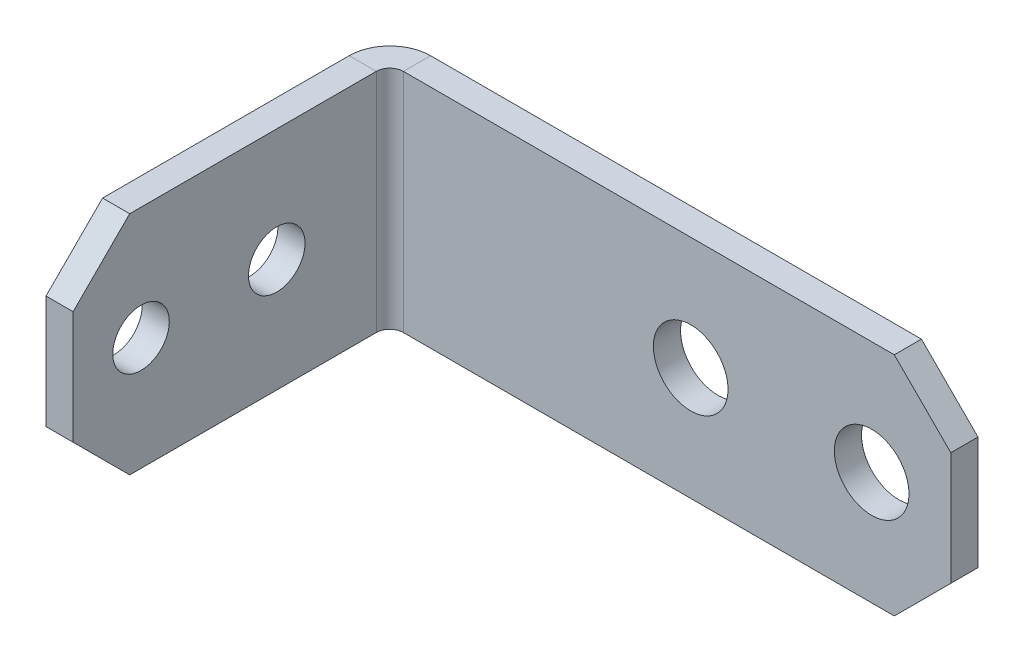
ISO-10303-21;
HEADER;
FILE_DESCRIPTION(('STEP AP214'),'2;1');
FILE_NAME('part.step','',(''),(''),'','','');
FILE_SCHEMA(('AUTOMOTIVE_DESIGN { 1 0 10303 214 1 1 1 1 }'));
ENDSEC;
DATA;
#1=APPLICATION_CONTEXT('core data for automotive mechanical design processes');
#2=APPLICATION_PROTOCOL_DEFINITION('international standard','automotive_design',2000,#1);
#3=PRODUCT_CONTEXT('',#1,'mechanical');
#4=PRODUCT('Part','Part','',(#3));
#5=PRODUCT_RELATED_PRODUCT_CATEGORY('part','',(#4));
#6=PRODUCT_DEFINITION_FORMATION('','',#4);
#7=PRODUCT_DEFINITION_CONTEXT('part definition',#1,'design');
#8=PRODUCT_DEFINITION('design','',#6,#7);
#9=PRODUCT_DEFINITION_SHAPE('','',#8);
#10=(LENGTH_UNIT() NAMED_UNIT(*) SI_UNIT(.MILLI.,.METRE.));
#11=(NAMED_UNIT(*) PLANE_ANGLE_UNIT() SI_UNIT($,.RADIAN.));
#12=(NAMED_UNIT(*) SI_UNIT($,.STERADIAN.) SOLID_ANGLE_UNIT());
#13=UNCERTAINTY_MEASURE_WITH_UNIT(LENGTH_MEASURE(1.E-05),#10,'distance_accuracy_value','');
#14=(GEOMETRIC_REPRESENTATION_CONTEXT(3) GLOBAL_UNCERTAINTY_ASSIGNED_CONTEXT((#13)) GLOBAL_UNIT_ASSIGNED_CONTEXT((#10,
#11,#12)) REPRESENTATION_CONTEXT('',''));
#15=CARTESIAN_POINT('',(0.,0.,0.));
#16=DIRECTION('',(0.,0.,1.));
#17=DIRECTION('',(1.,0.,0.));
#18=AXIS2_PLACEMENT_3D('',#15,#16,#17);
#19=CARTESIAN_POINT('',(13.,5.,1.2));
#20=DIRECTION('',(0.,0.,1.));
#21=DIRECTION('',(1.,0.,0.));
#22=AXIS2_PLACEMENT_3D('',#19,#20,#21);
#23=PLANE('',#22);
#24=CARTESIAN_POINT('',(22.5,5.,1.2));
#25=DIRECTION('',(0.,0.,-1.));
#26=DIRECTION('',(1.,0.,0.));
#27=AXIS2_PLACEMENT_3D('',#24,#25,#26);
#28=CIRCLE('',#27,1.65);
#29=CARTESIAN_POINT('',(20.85,5.,1.2));
#30=VERTEX_POINT('',#29);
#31=EDGE_CURVE('E221',#30,#30,#28,.T.);
#32=ORIENTED_EDGE('',*,*,#31,.T.);
#33=EDGE_LOOP('',(#32));
#34=FACE_BOUND('',#33,.T.);
#35=CARTESIAN_POINT('',(14.5,5.,1.2));
#36=DIRECTION('',(0.,0.,-1.));
#37=DIRECTION('',(1.,0.,0.));
#38=AXIS2_PLACEMENT_3D('',#35,#36,#37);
#39=CIRCLE('',#38,1.65);
#40=CARTESIAN_POINT('',(12.85,5.,1.2));
#41=VERTEX_POINT('',#40);
#42=EDGE_CURVE('E27',#41,#41,#39,.T.);
#43=ORIENTED_EDGE('',*,*,#42,.T.);
#44=EDGE_LOOP('',(#43));
#45=FACE_BOUND('',#44,.T.);
#46=DIRECTION('',(-0.707106781186548,-0.707106781186548,0.));
#47=VECTOR('',#46,1.);
#48=CARTESIAN_POINT('',(22.75,-0.75,1.2));
#49=LINE('',#48,#47);
#50=CARTESIAN_POINT('',(26.,2.5,1.2));
#51=VERTEX_POINT('',#50);
#52=CARTESIAN_POINT('',(23.5,0.,1.2));
#53=VERTEX_POINT('',#52);
#54=EDGE_CURVE('E263',#51,#53,#49,.T.);
#55=ORIENTED_EDGE('',*,*,#54,.F.);
#56=DIRECTION('',(0.,1.,0.));
#57=VECTOR('',#56,1.);
#58=CARTESIAN_POINT('',(26.,0.,1.2));
#59=LINE('',#58,#57);
#60=CARTESIAN_POINT('',(26.,7.5,1.2));
#61=VERTEX_POINT('',#60);
#62=EDGE_CURVE('E234',#51,#61,#59,.T.);
#63=ORIENTED_EDGE('',*,*,#62,.T.);
#64=DIRECTION('',(0.707106781186548,-0.707106781186548,0.));
#65=VECTOR('',#64,1.);
#66=CARTESIAN_POINT('',(22.75,10.75,1.2));
#67=LINE('',#66,#65);
#68=CARTESIAN_POINT('',(23.5,10.,1.2));
#69=VERTEX_POINT('',#68);
#70=EDGE_CURVE('E227',#69,#61,#67,.T.);
#71=ORIENTED_EDGE('',*,*,#70,.F.);
#72=DIRECTION('',(-1.,0.,0.));
#73=VECTOR('',#72,1.);
#74=CARTESIAN_POINT('',(26.,10.,1.2));
#75=LINE('',#74,#73);
#76=CARTESIAN_POINT('',(1.8,10.,1.2));
#77=VERTEX_POINT('',#76);
#78=EDGE_CURVE('E117',#69,#77,#75,.T.);
#79=ORIENTED_EDGE('',*,*,#78,.T.);
#80=DIRECTION('',(0.,-1.,0.));
#81=VECTOR('',#80,1.);
#82=CARTESIAN_POINT('',(1.8,7.5,1.2));
#83=LINE('',#82,#81);
#84=CARTESIAN_POINT('',(1.8,0.,1.2));
#85=VERTEX_POINT('',#84);
#86=EDGE_CURVE('E128',#77,#85,#83,.T.);
#87=ORIENTED_EDGE('',*,*,#86,.T.);
#88=DIRECTION('',(1.,0.,0.));
#89=VECTOR('',#88,1.);
#90=CARTESIAN_POINT('',(0.,0.,1.2));
#91=LINE('',#90,#89);
#92=EDGE_CURVE('E218',#85,#53,#91,.T.);
#93=ORIENTED_EDGE('',*,*,#92,.T.);
#94=EDGE_LOOP('',(#55,#63,#71,#79,#87,#93));
#95=FACE_BOUND('',#94,.T.);
#96=ADVANCED_FACE('F16',(#34,#45,#95),#23,.T.);
#97=CARTESIAN_POINT('',(14.5,5.,0.));
#98=DIRECTION('',(0.,0.,1.));
#99=DIRECTION('',(1.,0.,0.));
#100=AXIS2_PLACEMENT_3D('',#97,#98,#99);
#101=CYLINDRICAL_SURFACE('',#100,1.65);
#102=ORIENTED_EDGE('',*,*,#42,.F.);
#103=DIRECTION('',(0.,0.,-1.));
#104=VECTOR('',#103,1.);
#105=CARTESIAN_POINT('',(12.85,5.,0.));
#106=LINE('',#105,#104);
#107=CARTESIAN_POINT('',(12.85,5.,0.));
#108=VERTEX_POINT('',#107);
#109=EDGE_CURVE('E11',#41,#108,#106,.T.);
#110=ORIENTED_EDGE('',*,*,#109,.T.);
#111=CARTESIAN_POINT('',(14.5,5.,0.));
#112=DIRECTION('',(0.,0.,-1.));
#113=DIRECTION('',(1.,0.,0.));
#114=AXIS2_PLACEMENT_3D('',#111,#112,#113);
#115=CIRCLE('',#114,1.65);
#116=EDGE_CURVE('E231',#108,#108,#115,.T.);
#117=ORIENTED_EDGE('',*,*,#116,.T.);
#118=ORIENTED_EDGE('',*,*,#109,.F.);
#119=EDGE_LOOP('',(#102,#110,#117,#118));
#120=FACE_BOUND('',#119,.T.);
#121=ADVANCED_FACE('F444',(#120),#101,.F.);
#122=CARTESIAN_POINT('',(22.5,5.,0.));
#123=DIRECTION('',(0.,0.,1.));
#124=DIRECTION('',(1.,0.,0.));
#125=AXIS2_PLACEMENT_3D('',#122,#123,#124);
#126=CYLINDRICAL_SURFACE('',#125,1.65);
#127=ORIENTED_EDGE('',*,*,#31,.F.);
#128=DIRECTION('',(0.,0.,-1.));
#129=VECTOR('',#128,1.);
#130=CARTESIAN_POINT('',(20.85,5.,0.));
#131=LINE('',#130,#129);
#132=CARTESIAN_POINT('',(20.85,5.,0.));
#133=VERTEX_POINT('',#132);
#134=EDGE_CURVE('E302',#30,#133,#131,.T.);
#135=ORIENTED_EDGE('',*,*,#134,.T.);
#136=CARTESIAN_POINT('',(22.5,5.,0.));
#137=DIRECTION('',(0.,0.,-1.));
#138=DIRECTION('',(1.,0.,0.));
#139=AXIS2_PLACEMENT_3D('',#136,#137,#138);
#140=CIRCLE('',#139,1.65);
#141=EDGE_CURVE('E309',#133,#133,#140,.T.);
#142=ORIENTED_EDGE('',*,*,#141,.T.);
#143=ORIENTED_EDGE('',*,*,#134,.F.);
#144=EDGE_LOOP('',(#127,#135,#142,#143));
#145=FACE_BOUND('',#144,.T.);
#146=ADVANCED_FACE('F450',(#145),#126,.F.);
#147=CARTESIAN_POINT('',(0.,0.,0.));
#148=DIRECTION('',(0.,-1.,0.));
#149=DIRECTION('',(0.,0.,-1.));
#150=AXIS2_PLACEMENT_3D('',#147,#148,#149);
#151=PLANE('',#150);
#152=DIRECTION('',(0.,0.,-1.));
#153=VECTOR('',#152,1.);
#154=CARTESIAN_POINT('',(23.5,0.,0.));
#155=LINE('',#154,#153);
#156=CARTESIAN_POINT('',(23.5,0.,0.));
#157=VERTEX_POINT('',#156);
#158=EDGE_CURVE('E216',#53,#157,#155,.T.);
#159=ORIENTED_EDGE('',*,*,#158,.F.);
#160=ORIENTED_EDGE('',*,*,#92,.F.);
#161=DIRECTION('',(0.,0.,-1.));
#162=VECTOR('',#161,1.);
#163=CARTESIAN_POINT('',(1.8,0.,0.6));
#164=LINE('',#163,#162);
#165=CARTESIAN_POINT('',(1.8,0.,0.));
#166=VERTEX_POINT('',#165);
#167=EDGE_CURVE('E333',#85,#166,#164,.T.);
#168=ORIENTED_EDGE('',*,*,#167,.T.);
#169=DIRECTION('',(1.,0.,0.));
#170=VECTOR('',#169,1.);
#171=CARTESIAN_POINT('',(0.,0.,0.));
#172=LINE('',#171,#170);
#173=EDGE_CURVE('E238',#166,#157,#172,.T.);
#174=ORIENTED_EDGE('',*,*,#173,.T.);
#175=EDGE_LOOP('',(#159,#160,#168,#174));
#176=FACE_BOUND('',#175,.T.);
#177=ADVANCED_FACE('F398',(#176),#151,.T.);
#178=CARTESIAN_POINT('',(0.,5.,7.61407087168768));
#179=DIRECTION('',(-1.,0.,0.));
#180=DIRECTION('',(0.,0.,1.));
#181=AXIS2_PLACEMENT_3D('',#178,#179,#180);
#182=PLANE('',#181);
#183=CARTESIAN_POINT('',(0.,5.,6.2));
#184=DIRECTION('',(1.,0.,0.));
#185=DIRECTION('',(0.,-1.,0.));
#186=AXIS2_PLACEMENT_3D('',#183,#184,#185);
#187=CIRCLE('',#186,1.25);
#188=CARTESIAN_POINT('',(0.,6.25,6.2));
#189=VERTEX_POINT('',#188);
#190=EDGE_CURVE('E245',#189,#189,#187,.T.);
#191=ORIENTED_EDGE('',*,*,#190,.T.);
#192=EDGE_LOOP('',(#191));
#193=FACE_BOUND('',#192,.T.);
#194=CARTESIAN_POINT('',(0.,5.,12.2));
#195=DIRECTION('',(1.,0.,0.));
#196=DIRECTION('',(0.,-1.,0.));
#197=AXIS2_PLACEMENT_3D('',#194,#195,#196);
#198=CIRCLE('',#197,1.25);
#199=CARTESIAN_POINT('',(0.,6.25,12.2));
#200=VERTEX_POINT('',#199);
#201=EDGE_CURVE('E278',#200,#200,#198,.T.);
#202=ORIENTED_EDGE('',*,*,#201,.T.);
#203=EDGE_LOOP('',(#202));
#204=FACE_BOUND('',#203,.T.);
#205=DIRECTION('',(0.,-0.707106781186548,0.707106781186548));
#206=VECTOR('',#205,1.);
#207=CARTESIAN_POINT('',(0.,9.39648228207808,13.3035177179219));
#208=LINE('',#207,#206);
#209=CARTESIAN_POINT('',(0.,10.,12.7));
#210=VERTEX_POINT('',#209);
#211=CARTESIAN_POINT('',(0.,7.5,15.2));
#212=VERTEX_POINT('',#211);
#213=EDGE_CURVE('E198',#210,#212,#208,.T.);
#214=ORIENTED_EDGE('',*,*,#213,.F.);
#215=DIRECTION('',(0.,0.,-1.));
#216=VECTOR('',#215,1.);
#217=CARTESIAN_POINT('',(0.,10.,1.8));
#218=LINE('',#217,#216);
#219=CARTESIAN_POINT('',(0.,10.,1.8));
#220=VERTEX_POINT('',#219);
#221=EDGE_CURVE('E195',#210,#220,#218,.T.);
#222=ORIENTED_EDGE('',*,*,#221,.T.);
#223=DIRECTION('',(0.,-1.,0.));
#224=VECTOR('',#223,1.);
#225=CARTESIAN_POINT('',(0.,5.,1.8));
#226=LINE('',#225,#224);
#227=CARTESIAN_POINT('',(0.,0.,1.8));
#228=VERTEX_POINT('',#227);
#229=EDGE_CURVE('E183',#220,#228,#226,.T.);
#230=ORIENTED_EDGE('',*,*,#229,.T.);
#231=DIRECTION('',(0.,0.,1.));
#232=VECTOR('',#231,1.);
#233=CARTESIAN_POINT('',(0.,0.,-1.74371651324929));
#234=LINE('',#233,#232);
#235=CARTESIAN_POINT('',(0.,0.,12.7));
#236=VERTEX_POINT('',#235);
#237=EDGE_CURVE('E240',#228,#236,#234,.T.);
#238=ORIENTED_EDGE('',*,*,#237,.T.);
#239=DIRECTION('',(0.,-0.707106781186548,-0.707106781186548));
#240=VECTOR('',#239,1.);
#241=CARTESIAN_POINT('',(0.,0.60351771792192,13.3035177179219));
#242=LINE('',#241,#240);
#243=CARTESIAN_POINT('',(0.,2.5,15.2));
#244=VERTEX_POINT('',#243);
#245=EDGE_CURVE('E258',#244,#236,#242,.T.);
#246=ORIENTED_EDGE('',*,*,#245,.F.);
#247=DIRECTION('',(0.,1.,0.));
#248=VECTOR('',#247,1.);
#249=CARTESIAN_POINT('',(0.,10.,15.2));
#250=LINE('',#249,#248);
#251=EDGE_CURVE('E275',#244,#212,#250,.T.);
#252=ORIENTED_EDGE('',*,*,#251,.T.);
#253=EDGE_LOOP('',(#214,#222,#230,#238,#246,#252));
#254=FACE_BOUND('',#253,.T.);
#255=ADVANCED_FACE('F196',(#193,#204,#254),#182,.T.);
#256=CARTESIAN_POINT('',(1.8,5.,1.8));
#257=DIRECTION('',(0.,1.,0.));
#258=DIRECTION('',(0.,0.,-1.));
#259=AXIS2_PLACEMENT_3D('',#256,#257,#258);
#260=CYLINDRICAL_SURFACE('',#259,0.6);
#261=DIRECTION('',(0.,1.,0.));
#262=VECTOR('',#261,1.);
#263=CARTESIAN_POINT('',(1.2,5.,1.8));
#264=LINE('',#263,#262);
#265=CARTESIAN_POINT('',(1.2,0.,1.8));
#266=VERTEX_POINT('',#265);
#267=CARTESIAN_POINT('',(1.2,10.,1.8));
#268=VERTEX_POINT('',#267);
#269=EDGE_CURVE('E267',#266,#268,#264,.T.);
#270=ORIENTED_EDGE('',*,*,#269,.F.);
#271=CARTESIAN_POINT('',(1.8,0.,1.8));
#272=DIRECTION('',(0.,-1.,0.));
#273=DIRECTION('',(-1.,0.,0.));
#274=AXIS2_PLACEMENT_3D('',#271,#272,#273);
#275=CIRCLE('',#274,0.6);
#276=EDGE_CURVE('E331',#266,#85,#275,.T.);
#277=ORIENTED_EDGE('',*,*,#276,.T.);
#278=ORIENTED_EDGE('',*,*,#86,.F.);
#279=CARTESIAN_POINT('',(1.8,10.,1.8));
#280=DIRECTION('',(0.,-1.,0.));
#281=DIRECTION('',(-1.,0.,0.));
#282=AXIS2_PLACEMENT_3D('',#279,#280,#281);
#283=CIRCLE('',#282,0.6);
#284=EDGE_CURVE('E341',#268,#77,#283,.T.);
#285=ORIENTED_EDGE('',*,*,#284,.F.);
#286=EDGE_LOOP('',(#270,#277,#278,#285));
#287=FACE_BOUND('',#286,.T.);
#288=ADVANCED_FACE('F411',(#287),#260,.F.);
#289=CARTESIAN_POINT('',(1.2,0.,15.2));
#290=DIRECTION('',(0.,0.,1.));
#291=DIRECTION('',(1.,0.,0.));
#292=AXIS2_PLACEMENT_3D('',#289,#290,#291);
#293=PLANE('',#292);
#294=DIRECTION('',(1.,0.,0.));
#295=VECTOR('',#294,1.);
#296=CARTESIAN_POINT('',(1.2,7.5,15.2));
#297=LINE('',#296,#295);
#298=CARTESIAN_POINT('',(1.2,7.5,15.2));
#299=VERTEX_POINT('',#298);
#300=EDGE_CURVE('E226',#212,#299,#297,.T.);
#301=ORIENTED_EDGE('',*,*,#300,.F.);
#302=ORIENTED_EDGE('',*,*,#251,.F.);
#303=DIRECTION('',(-1.,0.,0.));
#304=VECTOR('',#303,1.);
#305=CARTESIAN_POINT('',(1.2,2.5,15.2));
#306=LINE('',#305,#304);
#307=CARTESIAN_POINT('',(1.2,2.5,15.2));
#308=VERTEX_POINT('',#307);
#309=EDGE_CURVE('E243',#308,#244,#306,.T.);
#310=ORIENTED_EDGE('',*,*,#309,.F.);
#311=DIRECTION('',(0.,-1.,0.));
#312=VECTOR('',#311,1.);
#313=CARTESIAN_POINT('',(1.2,10.,15.2));
#314=LINE('',#313,#312);
#315=EDGE_CURVE('E203',#299,#308,#314,.T.);
#316=ORIENTED_EDGE('',*,*,#315,.F.);
#317=EDGE_LOOP('',(#301,#302,#310,#316));
#318=FACE_BOUND('',#317,.T.);
#319=ADVANCED_FACE('F464',(#318),#293,.T.);
#320=CARTESIAN_POINT('',(0.,0.,1.8));
#321=DIRECTION('',(0.,-1.,0.));
#322=DIRECTION('',(0.,0.,-1.));
#323=AXIS2_PLACEMENT_3D('',#320,#321,#322);
#324=PLANE('',#323);
#325=DIRECTION('',(1.,0.,0.));
#326=VECTOR('',#325,1.);
#327=CARTESIAN_POINT('',(0.936,0.,1.8));
#328=LINE('',#327,#326);
#329=EDGE_CURVE('E242',#228,#266,#328,.T.);
#330=ORIENTED_EDGE('',*,*,#329,.F.);
#331=CARTESIAN_POINT('',(1.8,0.,1.8));
#332=DIRECTION('',(0.,1.,0.));
#333=DIRECTION('',(0.,0.,-1.));
#334=AXIS2_PLACEMENT_3D('',#331,#332,#333);
#335=CIRCLE('',#334,1.8);
#336=EDGE_CURVE('E182',#166,#228,#335,.T.);
#337=ORIENTED_EDGE('',*,*,#336,.F.);
#338=ORIENTED_EDGE('',*,*,#167,.F.);
#339=ORIENTED_EDGE('',*,*,#276,.F.);
#340=EDGE_LOOP('',(#330,#337,#338,#339));
#341=FACE_BOUND('',#340,.T.);
#342=ADVANCED_FACE('F413',(#341),#324,.T.);
#343=CARTESIAN_POINT('',(1.2,10.,1.8));
#344=DIRECTION('',(0.,1.,0.));
#345=DIRECTION('',(1.,0.,0.));
#346=AXIS2_PLACEMENT_3D('',#343,#344,#345);
#347=PLANE('',#346);
#348=DIRECTION('',(-1.,0.,0.));
#349=VECTOR('',#348,1.);
#350=CARTESIAN_POINT('',(0.936,10.,1.8));
#351=LINE('',#350,#349);
#352=EDGE_CURVE('E175',#268,#220,#351,.T.);
#353=ORIENTED_EDGE('',*,*,#352,.F.);
#354=ORIENTED_EDGE('',*,*,#284,.T.);
#355=DIRECTION('',(0.,0.,1.));
#356=VECTOR('',#355,1.);
#357=CARTESIAN_POINT('',(1.8,10.,0.6));
#358=LINE('',#357,#356);
#359=CARTESIAN_POINT('',(1.8,10.,0.));
#360=VERTEX_POINT('',#359);
#361=EDGE_CURVE('E177',#360,#77,#358,.T.);
#362=ORIENTED_EDGE('',*,*,#361,.F.);
#363=CARTESIAN_POINT('',(1.8,10.,1.8));
#364=DIRECTION('',(0.,-1.,0.));
#365=DIRECTION('',(-1.,0.,0.));
#366=AXIS2_PLACEMENT_3D('',#363,#364,#365);
#367=CIRCLE('',#366,1.8);
#368=EDGE_CURVE('E171',#220,#360,#367,.T.);
#369=ORIENTED_EDGE('',*,*,#368,.F.);
#370=EDGE_LOOP('',(#353,#354,#362,#369));
#371=FACE_BOUND('',#370,.T.);
#372=ADVANCED_FACE('F173',(#371),#347,.T.);
#373=CARTESIAN_POINT('',(1.8,5.,1.8));
#374=DIRECTION('',(0.,1.,0.));
#375=DIRECTION('',(0.,0.,-1.));
#376=AXIS2_PLACEMENT_3D('',#373,#374,#375);
#377=CYLINDRICAL_SURFACE('',#376,1.8);
#378=ORIENTED_EDGE('',*,*,#229,.F.);
#379=ORIENTED_EDGE('',*,*,#368,.T.);
#380=DIRECTION('',(0.,1.,0.));
#381=VECTOR('',#380,1.);
#382=CARTESIAN_POINT('',(1.8,7.5,0.));
#383=LINE('',#382,#381);
#384=EDGE_CURVE('E294',#166,#360,#383,.T.);
#385=ORIENTED_EDGE('',*,*,#384,.F.);
#386=ORIENTED_EDGE('',*,*,#336,.T.);
#387=EDGE_LOOP('',(#378,#379,#385,#386));
#388=FACE_BOUND('',#387,.T.);
#389=ADVANCED_FACE('F187',(#388),#377,.T.);
#390=CARTESIAN_POINT('',(0.,5.,6.2));
#391=DIRECTION('',(1.,0.,0.));
#392=DIRECTION('',(0.,-1.,0.));
#393=AXIS2_PLACEMENT_3D('',#390,#391,#392);
#394=CYLINDRICAL_SURFACE('',#393,1.25);
#395=ORIENTED_EDGE('',*,*,#190,.F.);
#396=DIRECTION('',(1.,0.,0.));
#397=VECTOR('',#396,1.);
#398=CARTESIAN_POINT('',(0.,6.25,6.2));
#399=LINE('',#398,#397);
#400=CARTESIAN_POINT('',(1.2,6.25,6.2));
#401=VERTEX_POINT('',#400);
#402=EDGE_CURVE('E192',#189,#401,#399,.T.);
#403=ORIENTED_EDGE('',*,*,#402,.T.);
#404=CARTESIAN_POINT('',(1.2,5.,6.2));
#405=DIRECTION('',(-1.,0.,0.));
#406=DIRECTION('',(0.,-1.,0.));
#407=AXIS2_PLACEMENT_3D('',#404,#405,#406);
#408=CIRCLE('',#407,1.25);
#409=EDGE_CURVE('E262',#401,#401,#408,.T.);
#410=ORIENTED_EDGE('',*,*,#409,.F.);
#411=ORIENTED_EDGE('',*,*,#402,.F.);
#412=EDGE_LOOP('',(#395,#403,#410,#411));
#413=FACE_BOUND('',#412,.T.);
#414=ADVANCED_FACE('F470',(#413),#394,.F.);
#415=CARTESIAN_POINT('',(0.,5.,12.2));
#416=DIRECTION('',(1.,0.,0.));
#417=DIRECTION('',(0.,-1.,0.));
#418=AXIS2_PLACEMENT_3D('',#415,#416,#417);
#419=CYLINDRICAL_SURFACE('',#418,1.25);
#420=ORIENTED_EDGE('',*,*,#201,.F.);
#421=DIRECTION('',(1.,0.,0.));
#422=VECTOR('',#421,1.);
#423=CARTESIAN_POINT('',(0.,6.25,12.2));
#424=LINE('',#423,#422);
#425=CARTESIAN_POINT('',(1.2,6.25,12.2));
#426=VERTEX_POINT('',#425);
#427=EDGE_CURVE('E249',#200,#426,#424,.T.);
#428=ORIENTED_EDGE('',*,*,#427,.T.);
#429=CARTESIAN_POINT('',(1.2,5.,12.2));
#430=DIRECTION('',(-1.,0.,0.));
#431=DIRECTION('',(0.,-1.,0.));
#432=AXIS2_PLACEMENT_3D('',#429,#430,#431);
#433=CIRCLE('',#432,1.25);
#434=EDGE_CURVE('E271',#426,#426,#433,.T.);
#435=ORIENTED_EDGE('',*,*,#434,.F.);
#436=ORIENTED_EDGE('',*,*,#427,.F.);
#437=EDGE_LOOP('',(#420,#428,#435,#436));
#438=FACE_BOUND('',#437,.T.);
#439=ADVANCED_FACE('F361',(#438),#419,.F.);
#440=CARTESIAN_POINT('',(1.2,0.,0.0281417433753564));
#441=DIRECTION('',(0.,-1.,0.));
#442=DIRECTION('',(0.,0.,-1.));
#443=AXIS2_PLACEMENT_3D('',#440,#441,#442);
#444=PLANE('',#443);
#445=DIRECTION('',(1.,0.,0.));
#446=VECTOR('',#445,1.);
#447=CARTESIAN_POINT('',(1.2,0.,12.7));
#448=LINE('',#447,#446);
#449=CARTESIAN_POINT('',(1.2,0.,12.7));
#450=VERTEX_POINT('',#449);
#451=EDGE_CURVE('E254',#236,#450,#448,.T.);
#452=ORIENTED_EDGE('',*,*,#451,.F.);
#453=ORIENTED_EDGE('',*,*,#237,.F.);
#454=ORIENTED_EDGE('',*,*,#329,.T.);
#455=DIRECTION('',(0.,0.,-1.));
#456=VECTOR('',#455,1.);
#457=CARTESIAN_POINT('',(1.2,0.,-1.74371651324929));
#458=LINE('',#457,#456);
#459=EDGE_CURVE('E272',#450,#266,#458,.T.);
#460=ORIENTED_EDGE('',*,*,#459,.F.);
#461=EDGE_LOOP('',(#452,#453,#454,#460));
#462=FACE_BOUND('',#461,.T.);
#463=ADVANCED_FACE('F430',(#462),#444,.T.);
#464=CARTESIAN_POINT('',(1.2,1.25,13.95));
#465=DIRECTION('',(0.,-0.707106781186548,0.707106781186548));
#466=DIRECTION('',(-1.,0.,0.));
#467=AXIS2_PLACEMENT_3D('',#464,#465,#466);
#468=PLANE('',#467);
#469=ORIENTED_EDGE('',*,*,#245,.T.);
#470=ORIENTED_EDGE('',*,*,#451,.T.);
#471=DIRECTION('',(0.,0.707106781186548,0.707106781186548));
#472=VECTOR('',#471,1.);
#473=CARTESIAN_POINT('',(1.2,0.60351771792192,13.3035177179219));
#474=LINE('',#473,#472);
#475=EDGE_CURVE('E20',#450,#308,#474,.T.);
#476=ORIENTED_EDGE('',*,*,#475,.T.);
#477=ORIENTED_EDGE('',*,*,#309,.T.);
#478=EDGE_LOOP('',(#469,#470,#476,#477));
#479=FACE_BOUND('',#478,.T.);
#480=ADVANCED_FACE('F366',(#479),#468,.T.);
#481=CARTESIAN_POINT('',(1.2,5.,7.61407087168768));
#482=DIRECTION('',(-1.,0.,0.));
#483=DIRECTION('',(0.,0.,1.));
#484=AXIS2_PLACEMENT_3D('',#481,#482,#483);
#485=PLANE('',#484);
#486=ORIENTED_EDGE('',*,*,#409,.T.);
#487=EDGE_LOOP('',(#486));
#488=FACE_BOUND('',#487,.T.);
#489=ORIENTED_EDGE('',*,*,#434,.T.);
#490=EDGE_LOOP('',(#489));
#491=FACE_BOUND('',#490,.T.);
#492=DIRECTION('',(0.,0.707106781186548,-0.707106781186548));
#493=VECTOR('',#492,1.);
#494=CARTESIAN_POINT('',(1.2,9.39648228207808,13.3035177179219));
#495=LINE('',#494,#493);
#496=CARTESIAN_POINT('',(1.2,10.,12.7));
#497=VERTEX_POINT('',#496);
#498=EDGE_CURVE('E222',#299,#497,#495,.T.);
#499=ORIENTED_EDGE('',*,*,#498,.F.);
#500=ORIENTED_EDGE('',*,*,#315,.T.);
#501=ORIENTED_EDGE('',*,*,#475,.F.);
#502=ORIENTED_EDGE('',*,*,#459,.T.);
#503=ORIENTED_EDGE('',*,*,#269,.T.);
#504=DIRECTION('',(0.,0.,-1.));
#505=VECTOR('',#504,1.);
#506=CARTESIAN_POINT('',(1.2,10.,-1.74371651324929));
#507=LINE('',#506,#505);
#508=EDGE_CURVE('E205',#497,#268,#507,.T.);
#509=ORIENTED_EDGE('',*,*,#508,.F.);
#510=EDGE_LOOP('',(#499,#500,#501,#502,#503,#509));
#511=FACE_BOUND('',#510,.T.);
#512=ADVANCED_FACE('F363',(#488,#491,#511),#485,.F.);
#513=CARTESIAN_POINT('',(1.2,10.,15.2));
#514=DIRECTION('',(0.,1.,0.));
#515=DIRECTION('',(1.,0.,0.));
#516=AXIS2_PLACEMENT_3D('',#513,#514,#515);
#517=PLANE('',#516);
#518=DIRECTION('',(-1.,0.,0.));
#519=VECTOR('',#518,1.);
#520=CARTESIAN_POINT('',(1.2,10.,12.7));
#521=LINE('',#520,#519);
#522=EDGE_CURVE('E212',#497,#210,#521,.T.);
#523=ORIENTED_EDGE('',*,*,#522,.F.);
#524=ORIENTED_EDGE('',*,*,#508,.T.);
#525=ORIENTED_EDGE('',*,*,#352,.T.);
#526=ORIENTED_EDGE('',*,*,#221,.F.);
#527=EDGE_LOOP('',(#523,#524,#525,#526));
#528=FACE_BOUND('',#527,.T.);
#529=ADVANCED_FACE('F18',(#528),#517,.T.);
#530=CARTESIAN_POINT('',(1.2,8.75,13.95));
#531=DIRECTION('',(0.,0.707106781186548,0.707106781186548));
#532=DIRECTION('',(1.,0.,0.));
#533=AXIS2_PLACEMENT_3D('',#530,#531,#532);
#534=PLANE('',#533);
#535=ORIENTED_EDGE('',*,*,#213,.T.);
#536=ORIENTED_EDGE('',*,*,#300,.T.);
#537=ORIENTED_EDGE('',*,*,#498,.T.);
#538=ORIENTED_EDGE('',*,*,#522,.T.);
#539=EDGE_LOOP('',(#535,#536,#537,#538));
#540=FACE_BOUND('',#539,.T.);
#541=ADVANCED_FACE('F374',(#540),#534,.T.);
#542=CARTESIAN_POINT('',(26.,10.,0.));
#543=DIRECTION('',(0.,1.,0.));
#544=DIRECTION('',(1.,0.,0.));
#545=AXIS2_PLACEMENT_3D('',#542,#543,#544);
#546=PLANE('',#545);
#547=DIRECTION('',(0.,0.,1.));
#548=VECTOR('',#547,1.);
#549=CARTESIAN_POINT('',(23.5,10.,0.));
#550=LINE('',#549,#548);
#551=CARTESIAN_POINT('',(23.5,10.,0.));
#552=VERTEX_POINT('',#551);
#553=EDGE_CURVE('E230',#552,#69,#550,.T.);
#554=ORIENTED_EDGE('',*,*,#553,.F.);
#555=DIRECTION('',(-1.,0.,0.));
#556=VECTOR('',#555,1.);
#557=CARTESIAN_POINT('',(26.,10.,0.));
#558=LINE('',#557,#556);
#559=EDGE_CURVE('E298',#552,#360,#558,.T.);
#560=ORIENTED_EDGE('',*,*,#559,.T.);
#561=ORIENTED_EDGE('',*,*,#361,.T.);
#562=ORIENTED_EDGE('',*,*,#78,.F.);
#563=EDGE_LOOP('',(#554,#560,#561,#562));
#564=FACE_BOUND('',#563,.T.);
#565=ADVANCED_FACE('F415',(#564),#546,.T.);
#566=CARTESIAN_POINT('',(24.75,8.75,0.));
#567=DIRECTION('',(0.707106781186548,0.707106781186548,0.));
#568=DIRECTION('',(0.,0.,-1.));
#569=AXIS2_PLACEMENT_3D('',#566,#567,#568);
#570=PLANE('',#569);
#571=ORIENTED_EDGE('',*,*,#70,.T.);
#572=DIRECTION('',(0.,0.,-1.));
#573=VECTOR('',#572,1.);
#574=CARTESIAN_POINT('',(26.,7.5,0.));
#575=LINE('',#574,#573);
#576=CARTESIAN_POINT('',(26.,7.5,0.));
#577=VERTEX_POINT('',#576);
#578=EDGE_CURVE('E239',#61,#577,#575,.T.);
#579=ORIENTED_EDGE('',*,*,#578,.T.);
#580=DIRECTION('',(-0.707106781186548,0.707106781186548,0.));
#581=VECTOR('',#580,1.);
#582=CARTESIAN_POINT('',(22.75,10.75,0.));
#583=LINE('',#582,#581);
#584=EDGE_CURVE('E304',#577,#552,#583,.T.);
#585=ORIENTED_EDGE('',*,*,#584,.T.);
#586=ORIENTED_EDGE('',*,*,#553,.T.);
#587=EDGE_LOOP('',(#571,#579,#585,#586));
#588=FACE_BOUND('',#587,.T.);
#589=ADVANCED_FACE('F417',(#588),#570,.T.);
#590=CARTESIAN_POINT('',(13.,5.,0.));
#591=DIRECTION('',(0.,0.,1.));
#592=DIRECTION('',(1.,0.,0.));
#593=AXIS2_PLACEMENT_3D('',#590,#591,#592);
#594=PLANE('',#593);
#595=ORIENTED_EDGE('',*,*,#116,.F.);
#596=EDGE_LOOP('',(#595));
#597=FACE_BOUND('',#596,.T.);
#598=ORIENTED_EDGE('',*,*,#141,.F.);
#599=EDGE_LOOP('',(#598));
#600=FACE_BOUND('',#599,.T.);
#601=DIRECTION('',(0.707106781186548,0.707106781186548,0.));
#602=VECTOR('',#601,1.);
#603=CARTESIAN_POINT('',(22.75,-0.75,0.));
#604=LINE('',#603,#602);
#605=CARTESIAN_POINT('',(26.,2.5,0.));
#606=VERTEX_POINT('',#605);
#607=EDGE_CURVE('E293',#157,#606,#604,.T.);
#608=ORIENTED_EDGE('',*,*,#607,.F.);
#609=ORIENTED_EDGE('',*,*,#173,.F.);
#610=ORIENTED_EDGE('',*,*,#384,.T.);
#611=ORIENTED_EDGE('',*,*,#559,.F.);
#612=ORIENTED_EDGE('',*,*,#584,.F.);
#613=DIRECTION('',(0.,1.,0.));
#614=VECTOR('',#613,1.);
#615=CARTESIAN_POINT('',(26.,0.,0.));
#616=LINE('',#615,#614);
#617=EDGE_CURVE('E285',#606,#577,#616,.T.);
#618=ORIENTED_EDGE('',*,*,#617,.F.);
#619=EDGE_LOOP('',(#608,#609,#610,#611,#612,#618));
#620=FACE_BOUND('',#619,.T.);
#621=ADVANCED_FACE('F401',(#597,#600,#620),#594,.F.);
#622=CARTESIAN_POINT('',(26.,0.,0.));
#623=DIRECTION('',(1.,0.,0.));
#624=DIRECTION('',(0.,1.,0.));
#625=AXIS2_PLACEMENT_3D('',#622,#623,#624);
#626=PLANE('',#625);
#627=DIRECTION('',(0.,0.,1.));
#628=VECTOR('',#627,1.);
#629=CARTESIAN_POINT('',(26.,2.5,0.));
#630=LINE('',#629,#628);
#631=EDGE_CURVE('E289',#606,#51,#630,.T.);
#632=ORIENTED_EDGE('',*,*,#631,.F.);
#633=ORIENTED_EDGE('',*,*,#617,.T.);
#634=ORIENTED_EDGE('',*,*,#578,.F.);
#635=ORIENTED_EDGE('',*,*,#62,.F.);
#636=EDGE_LOOP('',(#632,#633,#634,#635));
#637=FACE_BOUND('',#636,.T.);
#638=ADVANCED_FACE('F407',(#637),#626,.T.);
#639=CARTESIAN_POINT('',(24.75,1.25,0.));
#640=DIRECTION('',(0.707106781186548,-0.707106781186548,0.));
#641=DIRECTION('',(0.,0.,-1.));
#642=AXIS2_PLACEMENT_3D('',#639,#640,#641);
#643=PLANE('',#642);
#644=ORIENTED_EDGE('',*,*,#54,.T.);
#645=ORIENTED_EDGE('',*,*,#158,.T.);
#646=ORIENTED_EDGE('',*,*,#607,.T.);
#647=ORIENTED_EDGE('',*,*,#631,.T.);
#648=EDGE_LOOP('',(#644,#645,#646,#647));
#649=FACE_BOUND('',#648,.T.);
#650=ADVANCED_FACE('F396',(#649),#643,.T.);
#651=CLOSED_SHELL('',(#96,#121,#146,#177,#255,#288,#319,#342,#372,#389,#414,#439,#463,#480,#512,
#529,#541,#565,#589,#621,#638,#650));
#652=MANIFOLD_SOLID_BREP('B1',#651);
#653=ADVANCED_BREP_SHAPE_REPRESENTATION('',(#18,#652),#14);
#654=SHAPE_DEFINITION_REPRESENTATION(#9,#653);
ENDSEC;
END-ISO-10303-21;
